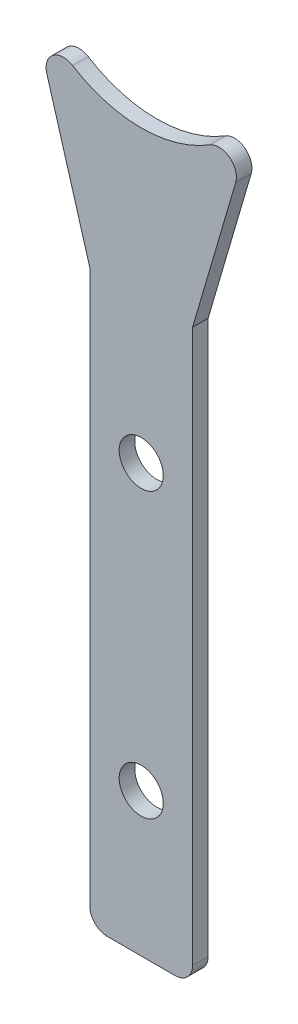
ISO-10303-21;
HEADER;
FILE_DESCRIPTION(('STEP AP214'),'2;1');
FILE_NAME('part.step','',(''),(''),'','','');
FILE_SCHEMA(('AUTOMOTIVE_DESIGN { 1 0 10303 214 1 1 1 1 }'));
ENDSEC;
DATA;
#1=APPLICATION_CONTEXT('core data for automotive mechanical design processes');
#2=APPLICATION_PROTOCOL_DEFINITION('international standard','automotive_design',2000,#1);
#3=PRODUCT_CONTEXT('',#1,'mechanical');
#4=PRODUCT('Part','Part','',(#3));
#5=PRODUCT_RELATED_PRODUCT_CATEGORY('part','',(#4));
#6=PRODUCT_DEFINITION_FORMATION('','',#4);
#7=PRODUCT_DEFINITION_CONTEXT('part definition',#1,'design');
#8=PRODUCT_DEFINITION('design','',#6,#7);
#9=PRODUCT_DEFINITION_SHAPE('','',#8);
#10=(LENGTH_UNIT() NAMED_UNIT(*) SI_UNIT(.MILLI.,.METRE.));
#11=(NAMED_UNIT(*) PLANE_ANGLE_UNIT() SI_UNIT($,.RADIAN.));
#12=(NAMED_UNIT(*) SI_UNIT($,.STERADIAN.) SOLID_ANGLE_UNIT());
#13=UNCERTAINTY_MEASURE_WITH_UNIT(LENGTH_MEASURE(1.E-05),#10,'distance_accuracy_value','');
#14=(GEOMETRIC_REPRESENTATION_CONTEXT(3) GLOBAL_UNCERTAINTY_ASSIGNED_CONTEXT((#13)) GLOBAL_UNIT_ASSIGNED_CONTEXT((#10,
#11,#12)) REPRESENTATION_CONTEXT('',''));
#15=CARTESIAN_POINT('',(0.,0.,0.));
#16=DIRECTION('',(0.,0.,1.));
#17=DIRECTION('',(1.,0.,0.));
#18=AXIS2_PLACEMENT_3D('',#15,#16,#17);
#19=CARTESIAN_POINT('',(-3.07892409853893,0.,1.5875));
#20=DIRECTION('',(-1.,0.,0.));
#21=DIRECTION('',(0.,0.,1.));
#22=AXIS2_PLACEMENT_3D('',#19,#20,#21);
#23=PLANE('',#22);
#24=DIRECTION('',(0.,1.,0.));
#25=VECTOR('',#24,1.);
#26=CARTESIAN_POINT('',(-3.07892409853893,0.,0.));
#27=LINE('',#26,#25);
#28=CARTESIAN_POINT('',(-3.07892409853893,-26.8398665511832,0.));
#29=VERTEX_POINT('',#28);
#30=CARTESIAN_POINT('',(-3.07892409853893,29.5681257650785,0.));
#31=VERTEX_POINT('',#30);
#32=EDGE_CURVE('E145',#29,#31,#27,.T.);
#33=ORIENTED_EDGE('',*,*,#32,.F.);
#34=DIRECTION('',(0.,0.,-1.));
#35=VECTOR('',#34,1.);
#36=CARTESIAN_POINT('',(-3.07892409853893,-26.8398665511832,1.5875));
#37=LINE('',#36,#35);
#38=CARTESIAN_POINT('',(-3.07892409853893,-26.8398665511832,1.5875));
#39=VERTEX_POINT('',#38);
#40=EDGE_CURVE('E182',#29,#39,#37,.F.);
#41=ORIENTED_EDGE('',*,*,#40,.T.);
#42=DIRECTION('',(0.,1.,0.));
#43=VECTOR('',#42,1.);
#44=CARTESIAN_POINT('',(-3.07892409853893,0.,1.5875));
#45=LINE('',#44,#43);
#46=CARTESIAN_POINT('',(-3.07892409853893,29.5681257650785,1.5875));
#47=VERTEX_POINT('',#46);
#48=EDGE_CURVE('E160',#39,#47,#45,.T.);
#49=ORIENTED_EDGE('',*,*,#48,.T.);
#50=DIRECTION('',(0.,0.,-1.));
#51=VECTOR('',#50,1.);
#52=CARTESIAN_POINT('',(-3.07892409853893,29.5681257650785,1.5875));
#53=LINE('',#52,#51);
#54=EDGE_CURVE('E134',#47,#31,#53,.T.);
#55=ORIENTED_EDGE('',*,*,#54,.T.);
#56=EDGE_LOOP('',(#33,#41,#49,#55));
#57=FACE_BOUND('',#56,.T.);
#58=ADVANCED_FACE('F36',(#57),#23,.T.);
#59=CARTESIAN_POINT('',(0.,-28.6178665511832,1.5875));
#60=DIRECTION('',(0.,1.,0.));
#61=DIRECTION('',(0.,0.,1.));
#62=AXIS2_PLACEMENT_3D('',#59,#60,#61);
#63=PLANE('',#62);
#64=DIRECTION('',(1.,0.,0.));
#65=VECTOR('',#64,1.);
#66=CARTESIAN_POINT('',(0.,-28.6178665511832,0.));
#67=LINE('',#66,#65);
#68=CARTESIAN_POINT('',(-1.30092409853893,-28.6178665511832,0.));
#69=VERTEX_POINT('',#68);
#70=CARTESIAN_POINT('',(5.6212608166147,-28.6178665511832,0.));
#71=VERTEX_POINT('',#70);
#72=EDGE_CURVE('E147',#69,#71,#67,.T.);
#73=ORIENTED_EDGE('',*,*,#72,.T.);
#74=DIRECTION('',(0.,0.,-1.));
#75=VECTOR('',#74,1.);
#76=CARTESIAN_POINT('',(5.6212608166147,-28.6178665511832,1.5875));
#77=LINE('',#76,#75);
#78=CARTESIAN_POINT('',(5.6212608166147,-28.6178665511832,1.5875));
#79=VERTEX_POINT('',#78);
#80=EDGE_CURVE('E175',#71,#79,#77,.F.);
#81=ORIENTED_EDGE('',*,*,#80,.T.);
#82=DIRECTION('',(1.,0.,0.));
#83=VECTOR('',#82,1.);
#84=CARTESIAN_POINT('',(0.,-28.6178665511832,1.5875));
#85=LINE('',#84,#83);
#86=CARTESIAN_POINT('',(-1.30092409853893,-28.6178665511832,1.5875));
#87=VERTEX_POINT('',#86);
#88=EDGE_CURVE('E123',#87,#79,#85,.T.);
#89=ORIENTED_EDGE('',*,*,#88,.F.);
#90=DIRECTION('',(0.,0.,-1.));
#91=VECTOR('',#90,1.);
#92=CARTESIAN_POINT('',(-1.30092409853893,-28.6178665511832,0.));
#93=LINE('',#92,#91);
#94=EDGE_CURVE('E172',#87,#69,#93,.T.);
#95=ORIENTED_EDGE('',*,*,#94,.T.);
#96=EDGE_LOOP('',(#73,#81,#89,#95));
#97=FACE_BOUND('',#96,.T.);
#98=ADVANCED_FACE('F215',(#97),#63,.F.);
#99=CARTESIAN_POINT('',(7.3992608166147,0.,1.5875));
#100=DIRECTION('',(-1.,0.,0.));
#101=DIRECTION('',(0.,0.,1.));
#102=AXIS2_PLACEMENT_3D('',#99,#100,#101);
#103=PLANE('',#102);
#104=DIRECTION('',(0.,1.,0.));
#105=VECTOR('',#104,1.);
#106=CARTESIAN_POINT('',(7.3992608166147,0.,1.5875));
#107=LINE('',#106,#105);
#108=CARTESIAN_POINT('',(7.3992608166147,-26.8398665511832,1.5875));
#109=VERTEX_POINT('',#108);
#110=CARTESIAN_POINT('',(7.3992608166147,29.5674380976494,1.5875));
#111=VERTEX_POINT('',#110);
#112=EDGE_CURVE('E112',#109,#111,#107,.T.);
#113=ORIENTED_EDGE('',*,*,#112,.F.);
#114=DIRECTION('',(0.,0.,-1.));
#115=VECTOR('',#114,1.);
#116=CARTESIAN_POINT('',(7.3992608166147,-26.8398665511832,1.5875));
#117=LINE('',#116,#115);
#118=CARTESIAN_POINT('',(7.3992608166147,-26.8398665511832,0.));
#119=VERTEX_POINT('',#118);
#120=EDGE_CURVE('E133',#109,#119,#117,.T.);
#121=ORIENTED_EDGE('',*,*,#120,.T.);
#122=DIRECTION('',(0.,1.,0.));
#123=VECTOR('',#122,1.);
#124=CARTESIAN_POINT('',(7.3992608166147,0.,0.));
#125=LINE('',#124,#123);
#126=CARTESIAN_POINT('',(7.3992608166147,29.5674380976494,0.));
#127=VERTEX_POINT('',#126);
#128=EDGE_CURVE('E129',#119,#127,#125,.T.);
#129=ORIENTED_EDGE('',*,*,#128,.T.);
#130=DIRECTION('',(0.,0.,-1.));
#131=VECTOR('',#130,1.);
#132=CARTESIAN_POINT('',(7.3992608166147,29.5674380976494,1.5875));
#133=LINE('',#132,#131);
#134=EDGE_CURVE('E126',#111,#127,#133,.T.);
#135=ORIENTED_EDGE('',*,*,#134,.F.);
#136=EDGE_LOOP('',(#113,#121,#129,#135));
#137=FACE_BOUND('',#136,.T.);
#138=ADVANCED_FACE('F127',(#137),#103,.F.);
#139=CARTESIAN_POINT('',(-1.17350496100041,0.344253485824923,1.5875));
#140=DIRECTION('',(-0.959563379769417,0.281492664567825,0.));
#141=DIRECTION('',(-0.281492664567825,-0.959563379769417,0.));
#142=AXIS2_PLACEMENT_3D('',#139,#140,#141);
#143=PLANE('',#142);
#144=DIRECTION('',(0.281492664567825,0.959563379769417,0.));
#145=VECTOR('',#144,1.);
#146=CARTESIAN_POINT('',(-1.17350496100041,0.344253485824923,0.));
#147=LINE('',#146,#145);
#148=CARTESIAN_POINT('',(11.797677483723,44.5609355985677,0.));
#149=VERTEX_POINT('',#148);
#150=EDGE_CURVE('E152',#127,#149,#147,.T.);
#151=ORIENTED_EDGE('',*,*,#150,.T.);
#152=DIRECTION('',(0.,0.,1.));
#153=VECTOR('',#152,1.);
#154=CARTESIAN_POINT('',(11.7976774837229,44.5609355985677,1.5875));
#155=LINE('',#154,#153);
#156=CARTESIAN_POINT('',(11.797677483723,44.5609355985677,1.5875));
#157=VERTEX_POINT('',#156);
#158=EDGE_CURVE('E11',#149,#157,#155,.T.);
#159=ORIENTED_EDGE('',*,*,#158,.T.);
#160=DIRECTION('',(0.281492664567825,0.959563379769417,0.));
#161=VECTOR('',#160,1.);
#162=CARTESIAN_POINT('',(-1.17350496100041,0.344253485824923,1.5875));
#163=LINE('',#162,#161);
#164=EDGE_CURVE('E117',#111,#157,#163,.T.);
#165=ORIENTED_EDGE('',*,*,#164,.F.);
#166=ORIENTED_EDGE('',*,*,#134,.T.);
#167=EDGE_LOOP('',(#151,#159,#165,#166));
#168=FACE_BOUND('',#167,.T.);
#169=ADVANCED_FACE('F136',(#168),#143,.F.);
#170=CARTESIAN_POINT('',(2.15899651451928,57.7781257347074,1.5875));
#171=DIRECTION('',(0.,0.,-1.));
#172=DIRECTION('',(-1.,0.,0.));
#173=AXIS2_PLACEMENT_3D('',#170,#171,#172);
#174=CYLINDRICAL_SURFACE('',#173,13.21);
#175=CARTESIAN_POINT('',(2.15899651451928,57.7781257347074,0.));
#176=DIRECTION('',(0.,0.,1.));
#177=DIRECTION('',(1.,0.,0.));
#178=AXIS2_PLACEMENT_3D('',#175,#176,#177);
#179=CIRCLE('',#178,13.21);
#180=CARTESIAN_POINT('',(-4.83166565654206,46.5694352487456,0.));
#181=VERTEX_POINT('',#180);
#182=CARTESIAN_POINT('',(9.15054614545415,46.5699887905862,0.));
#183=VERTEX_POINT('',#182);
#184=EDGE_CURVE('E154',#181,#183,#179,.T.);
#185=ORIENTED_EDGE('',*,*,#184,.F.);
#186=DIRECTION('',(0.,0.,-1.));
#187=VECTOR('',#186,1.);
#188=CARTESIAN_POINT('',(-4.83166565654206,46.5694352487456,1.5875));
#189=LINE('',#188,#187);
#190=CARTESIAN_POINT('',(-4.83166565654206,46.5694352487456,1.5875));
#191=VERTEX_POINT('',#190);
#192=EDGE_CURVE('E44',#181,#191,#189,.F.);
#193=ORIENTED_EDGE('',*,*,#192,.T.);
#194=CARTESIAN_POINT('',(2.15899651451928,57.7781257347074,1.5875));
#195=DIRECTION('',(0.,0.,1.));
#196=DIRECTION('',(1.,0.,0.));
#197=AXIS2_PLACEMENT_3D('',#194,#195,#196);
#198=CIRCLE('',#197,13.21);
#199=CARTESIAN_POINT('',(9.15054614545415,46.5699887905862,1.5875));
#200=VERTEX_POINT('',#199);
#201=EDGE_CURVE('E138',#191,#200,#198,.T.);
#202=ORIENTED_EDGE('',*,*,#201,.T.);
#203=DIRECTION('',(0.,0.,-1.));
#204=VECTOR('',#203,1.);
#205=CARTESIAN_POINT('',(9.15054614545415,46.5699887905862,1.5875));
#206=LINE('',#205,#204);
#207=EDGE_CURVE('E187',#200,#183,#206,.T.);
#208=ORIENTED_EDGE('',*,*,#207,.T.);
#209=EDGE_LOOP('',(#185,#193,#202,#208));
#210=FACE_BOUND('',#209,.T.);
#211=ADVANCED_FACE('F192',(#210),#174,.F.);
#212=CARTESIAN_POINT('',(5.15450049417575,1.51269052761799,1.5875));
#213=DIRECTION('',(-0.959533591868492,-0.281594186864627,0.));
#214=DIRECTION('',(0.281594186864627,-0.959533591868492,0.));
#215=AXIS2_PLACEMENT_3D('',#212,#213,#214);
#216=PLANE('',#215);
#217=DIRECTION('',(-0.281594186864627,0.959533591868492,0.));
#218=VECTOR('',#217,1.);
#219=CARTESIAN_POINT('',(5.15450049417575,1.51269052761799,1.5875));
#220=LINE('',#219,#218);
#221=CARTESIAN_POINT('',(-7.47862458425798,44.5601270461172,1.5875));
#222=VERTEX_POINT('',#221);
#223=EDGE_CURVE('E140',#47,#222,#220,.T.);
#224=ORIENTED_EDGE('',*,*,#223,.T.);
#225=DIRECTION('',(0.,0.,-1.));
#226=VECTOR('',#225,1.);
#227=CARTESIAN_POINT('',(-7.47862458425797,44.5601270461172,1.5875));
#228=LINE('',#227,#226);
#229=CARTESIAN_POINT('',(-7.47862458425798,44.5601270461172,0.));
#230=VERTEX_POINT('',#229);
#231=EDGE_CURVE('E184',#222,#230,#228,.T.);
#232=ORIENTED_EDGE('',*,*,#231,.T.);
#233=DIRECTION('',(-0.281594186864627,0.959533591868492,0.));
#234=VECTOR('',#233,1.);
#235=CARTESIAN_POINT('',(5.15450049417575,1.51269052761799,0.));
#236=LINE('',#235,#234);
#237=EDGE_CURVE('E157',#31,#230,#236,.T.);
#238=ORIENTED_EDGE('',*,*,#237,.F.);
#239=ORIENTED_EDGE('',*,*,#54,.F.);
#240=EDGE_LOOP('',(#224,#232,#238,#239));
#241=FACE_BOUND('',#240,.T.);
#242=ADVANCED_FACE('F199',(#241),#216,.T.);
#243=CARTESIAN_POINT('',(0.,0.,1.5875));
#244=DIRECTION('',(0.,0.,1.));
#245=DIRECTION('',(1.,0.,0.));
#246=AXIS2_PLACEMENT_3D('',#243,#244,#245);
#247=PLANE('',#246);
#248=CARTESIAN_POINT('',(2.1599510468991,14.9571257688168,1.5875));
#249=DIRECTION('',(0.,0.,1.));
#250=DIRECTION('',(1.,0.,0.));
#251=AXIS2_PLACEMENT_3D('',#248,#249,#250);
#252=CIRCLE('',#251,2.24999999999999);
#253=CARTESIAN_POINT('',(4.40995104689909,14.9571257688168,1.5875));
#254=VERTEX_POINT('',#253);
#255=EDGE_CURVE('E228',#254,#254,#252,.T.);
#256=ORIENTED_EDGE('',*,*,#255,.F.);
#257=EDGE_LOOP('',(#256));
#258=FACE_BOUND('',#257,.T.);
#259=CARTESIAN_POINT('',(2.15995104689911,-14.0068665511832,1.5875));
#260=DIRECTION('',(0.,0.,1.));
#261=DIRECTION('',(1.,0.,0.));
#262=AXIS2_PLACEMENT_3D('',#259,#260,#261);
#263=CIRCLE('',#262,2.24999999999999);
#264=CARTESIAN_POINT('',(4.4099510468991,-14.0068665511832,1.5875));
#265=VERTEX_POINT('',#264);
#266=EDGE_CURVE('E222',#265,#265,#263,.T.);
#267=ORIENTED_EDGE('',*,*,#266,.F.);
#268=EDGE_LOOP('',(#267));
#269=FACE_BOUND('',#268,.T.);
#270=ORIENTED_EDGE('',*,*,#88,.T.);
#271=CARTESIAN_POINT('',(5.6212608166147,-26.8398665511832,1.5875));
#272=DIRECTION('',(0.,0.,1.));
#273=DIRECTION('',(1.,0.,0.));
#274=AXIS2_PLACEMENT_3D('',#271,#272,#273);
#275=CIRCLE('',#274,1.778);
#276=EDGE_CURVE('E119',#79,#109,#275,.T.);
#277=ORIENTED_EDGE('',*,*,#276,.T.);
#278=ORIENTED_EDGE('',*,*,#112,.T.);
#279=ORIENTED_EDGE('',*,*,#164,.T.);
#280=CARTESIAN_POINT('',(10.0915737944929,45.0614295561693,1.5875));
#281=DIRECTION('',(0.,0.,1.));
#282=DIRECTION('',(1.,0.,0.));
#283=AXIS2_PLACEMENT_3D('',#280,#281,#282);
#284=CIRCLE('',#283,1.778);
#285=EDGE_CURVE('E57',#157,#200,#284,.T.);
#286=ORIENTED_EDGE('',*,*,#285,.T.);
#287=ORIENTED_EDGE('',*,*,#201,.F.);
#288=CARTESIAN_POINT('',(-5.7725738579158,45.0608015103625,1.5875));
#289=DIRECTION('',(0.,0.,1.));
#290=DIRECTION('',(1.,0.,0.));
#291=AXIS2_PLACEMENT_3D('',#288,#289,#290);
#292=CIRCLE('',#291,1.778);
#293=EDGE_CURVE('E51',#191,#222,#292,.T.);
#294=ORIENTED_EDGE('',*,*,#293,.T.);
#295=ORIENTED_EDGE('',*,*,#223,.F.);
#296=ORIENTED_EDGE('',*,*,#48,.F.);
#297=CARTESIAN_POINT('',(-1.30092409853893,-26.8398665511832,1.5875));
#298=DIRECTION('',(0.,0.,1.));
#299=DIRECTION('',(1.,0.,0.));
#300=AXIS2_PLACEMENT_3D('',#297,#298,#299);
#301=CIRCLE('',#300,1.778);
#302=EDGE_CURVE('E179',#39,#87,#301,.T.);
#303=ORIENTED_EDGE('',*,*,#302,.T.);
#304=EDGE_LOOP('',(#270,#277,#278,#279,#286,#287,#294,#295,#296,#303));
#305=FACE_BOUND('',#304,.T.);
#306=ADVANCED_FACE('F115',(#258,#269,#305),#247,.T.);
#307=CARTESIAN_POINT('',(0.,0.,0.));
#308=DIRECTION('',(0.,0.,1.));
#309=DIRECTION('',(1.,0.,0.));
#310=AXIS2_PLACEMENT_3D('',#307,#308,#309);
#311=PLANE('',#310);
#312=CARTESIAN_POINT('',(2.1599510468991,14.9571257688168,0.));
#313=DIRECTION('',(0.,0.,1.));
#314=DIRECTION('',(1.,0.,0.));
#315=AXIS2_PLACEMENT_3D('',#312,#313,#314);
#316=CIRCLE('',#315,2.25);
#317=CARTESIAN_POINT('',(4.4099510468991,14.9571257688168,0.));
#318=VERTEX_POINT('',#317);
#319=EDGE_CURVE('E225',#318,#318,#316,.T.);
#320=ORIENTED_EDGE('',*,*,#319,.T.);
#321=EDGE_LOOP('',(#320));
#322=FACE_BOUND('',#321,.T.);
#323=CARTESIAN_POINT('',(2.15995104689911,-14.0068665511832,0.));
#324=DIRECTION('',(0.,0.,1.));
#325=DIRECTION('',(1.,0.,0.));
#326=AXIS2_PLACEMENT_3D('',#323,#324,#325);
#327=CIRCLE('',#326,2.25);
#328=CARTESIAN_POINT('',(4.40995104689911,-14.0068665511832,0.));
#329=VERTEX_POINT('',#328);
#330=EDGE_CURVE('E148',#329,#329,#327,.T.);
#331=ORIENTED_EDGE('',*,*,#330,.T.);
#332=EDGE_LOOP('',(#331));
#333=FACE_BOUND('',#332,.T.);
#334=ORIENTED_EDGE('',*,*,#128,.F.);
#335=CARTESIAN_POINT('',(5.6212608166147,-26.8398665511832,0.));
#336=DIRECTION('',(0.,0.,1.));
#337=DIRECTION('',(1.,0.,0.));
#338=AXIS2_PLACEMENT_3D('',#335,#336,#337);
#339=CIRCLE('',#338,1.778);
#340=EDGE_CURVE('E170',#119,#71,#339,.F.);
#341=ORIENTED_EDGE('',*,*,#340,.T.);
#342=ORIENTED_EDGE('',*,*,#72,.F.);
#343=CARTESIAN_POINT('',(-1.30092409853893,-26.8398665511832,0.));
#344=DIRECTION('',(0.,0.,1.));
#345=DIRECTION('',(1.,0.,0.));
#346=AXIS2_PLACEMENT_3D('',#343,#344,#345);
#347=CIRCLE('',#346,1.778);
#348=EDGE_CURVE('E168',#69,#29,#347,.F.);
#349=ORIENTED_EDGE('',*,*,#348,.T.);
#350=ORIENTED_EDGE('',*,*,#32,.T.);
#351=ORIENTED_EDGE('',*,*,#237,.T.);
#352=CARTESIAN_POINT('',(-5.7725738579158,45.0608015103625,0.));
#353=DIRECTION('',(0.,0.,1.));
#354=DIRECTION('',(1.,0.,0.));
#355=AXIS2_PLACEMENT_3D('',#352,#353,#354);
#356=CIRCLE('',#355,1.778);
#357=EDGE_CURVE('E166',#230,#181,#356,.F.);
#358=ORIENTED_EDGE('',*,*,#357,.T.);
#359=ORIENTED_EDGE('',*,*,#184,.T.);
#360=CARTESIAN_POINT('',(10.0915737944929,45.0614295561693,0.));
#361=DIRECTION('',(0.,0.,1.));
#362=DIRECTION('',(1.,0.,0.));
#363=AXIS2_PLACEMENT_3D('',#360,#361,#362);
#364=CIRCLE('',#363,1.778);
#365=EDGE_CURVE('E164',#183,#149,#364,.F.);
#366=ORIENTED_EDGE('',*,*,#365,.T.);
#367=ORIENTED_EDGE('',*,*,#150,.F.);
#368=EDGE_LOOP('',(#334,#341,#342,#349,#350,#351,#358,#359,#366,#367));
#369=FACE_BOUND('',#368,.T.);
#370=ADVANCED_FACE('F202',(#322,#333,#369),#311,.F.);
#371=CARTESIAN_POINT('',(5.6212608166147,-26.8398665511832,1.5875));
#372=DIRECTION('',(0.,0.,-1.));
#373=DIRECTION('',(-1.,0.,0.));
#374=AXIS2_PLACEMENT_3D('',#371,#372,#373);
#375=CYLINDRICAL_SURFACE('',#374,1.778);
#376=ORIENTED_EDGE('',*,*,#276,.F.);
#377=ORIENTED_EDGE('',*,*,#80,.F.);
#378=ORIENTED_EDGE('',*,*,#340,.F.);
#379=ORIENTED_EDGE('',*,*,#120,.F.);
#380=EDGE_LOOP('',(#376,#377,#378,#379));
#381=FACE_BOUND('',#380,.T.);
#382=ADVANCED_FACE('F218',(#381),#375,.T.);
#383=CARTESIAN_POINT('',(-1.30092409853893,-26.8398665511832,1.5875));
#384=DIRECTION('',(0.,0.,1.));
#385=DIRECTION('',(1.,0.,0.));
#386=AXIS2_PLACEMENT_3D('',#383,#384,#385);
#387=CYLINDRICAL_SURFACE('',#386,1.778);
#388=ORIENTED_EDGE('',*,*,#302,.F.);
#389=ORIENTED_EDGE('',*,*,#40,.F.);
#390=ORIENTED_EDGE('',*,*,#348,.F.);
#391=ORIENTED_EDGE('',*,*,#94,.F.);
#392=EDGE_LOOP('',(#388,#389,#390,#391));
#393=FACE_BOUND('',#392,.T.);
#394=ADVANCED_FACE('F213',(#393),#387,.T.);
#395=CARTESIAN_POINT('',(-5.7725738579158,45.0608015103625,1.5875));
#396=DIRECTION('',(0.,0.,-1.));
#397=DIRECTION('',(-1.,0.,0.));
#398=AXIS2_PLACEMENT_3D('',#395,#396,#397);
#399=CYLINDRICAL_SURFACE('',#398,1.778);
#400=ORIENTED_EDGE('',*,*,#293,.F.);
#401=ORIENTED_EDGE('',*,*,#192,.F.);
#402=ORIENTED_EDGE('',*,*,#357,.F.);
#403=ORIENTED_EDGE('',*,*,#231,.F.);
#404=EDGE_LOOP('',(#400,#401,#402,#403));
#405=FACE_BOUND('',#404,.T.);
#406=ADVANCED_FACE('F196',(#405),#399,.T.);
#407=CARTESIAN_POINT('',(10.0915737944929,45.0614295561693,1.5875));
#408=DIRECTION('',(0.,0.,-1.));
#409=DIRECTION('',(-1.,0.,0.));
#410=AXIS2_PLACEMENT_3D('',#407,#408,#409);
#411=CYLINDRICAL_SURFACE('',#410,1.778);
#412=ORIENTED_EDGE('',*,*,#285,.F.);
#413=ORIENTED_EDGE('',*,*,#158,.F.);
#414=ORIENTED_EDGE('',*,*,#365,.F.);
#415=ORIENTED_EDGE('',*,*,#207,.F.);
#416=EDGE_LOOP('',(#412,#413,#414,#415));
#417=FACE_BOUND('',#416,.T.);
#418=ADVANCED_FACE('F38',(#417),#411,.T.);
#419=CARTESIAN_POINT('',(2.15995104689911,-14.0068665511832,1.5875));
#420=DIRECTION('',(0.,0.,1.));
#421=DIRECTION('',(1.,0.,0.));
#422=AXIS2_PLACEMENT_3D('',#419,#420,#421);
#423=CYLINDRICAL_SURFACE('',#422,2.24999999999999);
#424=ORIENTED_EDGE('',*,*,#330,.F.);
#425=EDGE_LOOP('',(#424));
#426=FACE_BOUND('',#425,.T.);
#427=ORIENTED_EDGE('',*,*,#266,.T.);
#428=EDGE_LOOP('',(#427));
#429=FACE_BOUND('',#428,.T.);
#430=ADVANCED_FACE('F239',(#426,#429),#423,.F.);
#431=CARTESIAN_POINT('',(2.1599510468991,14.9571257688168,1.5875));
#432=DIRECTION('',(0.,0.,1.));
#433=DIRECTION('',(1.,0.,0.));
#434=AXIS2_PLACEMENT_3D('',#431,#432,#433);
#435=CYLINDRICAL_SURFACE('',#434,2.24999999999999);
#436=ORIENTED_EDGE('',*,*,#319,.F.);
#437=EDGE_LOOP('',(#436));
#438=FACE_BOUND('',#437,.T.);
#439=ORIENTED_EDGE('',*,*,#255,.T.);
#440=EDGE_LOOP('',(#439));
#441=FACE_BOUND('',#440,.T.);
#442=ADVANCED_FACE('F232',(#438,#441),#435,.F.);
#443=CLOSED_SHELL('',(#58,#98,#138,#169,#211,#242,#306,#370,#382,#394,#406,#418,#430,#442));
#444=MANIFOLD_SOLID_BREP('B2',#443);
#445=ADVANCED_BREP_SHAPE_REPRESENTATION('',(#18,#444),#14);
#446=SHAPE_DEFINITION_REPRESENTATION(#9,#445);
ENDSEC;
END-ISO-10303-21;
